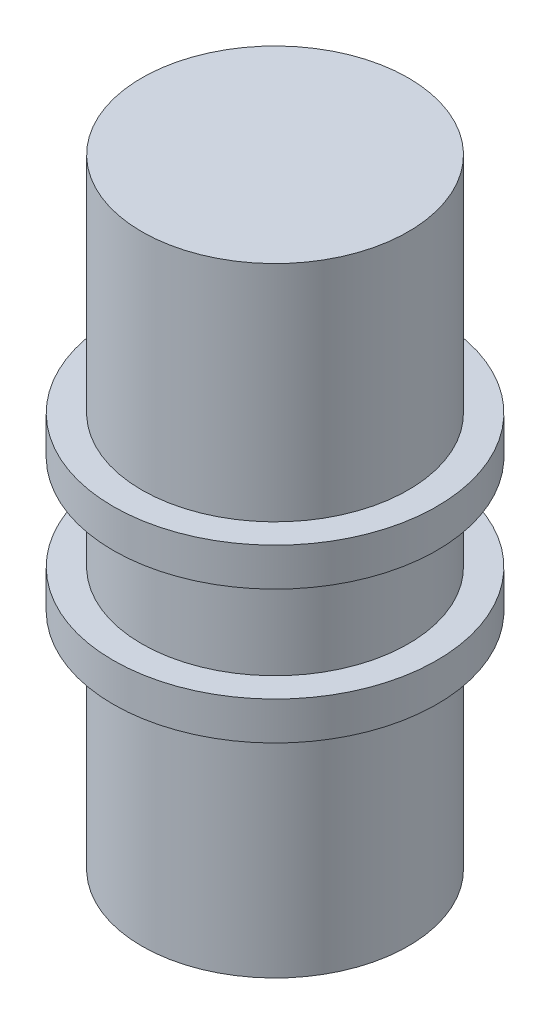
ISO-10303-21;
HEADER;
FILE_DESCRIPTION(('STEP AP214'),'2;1');
FILE_NAME('part.step','',(''),(''),'','','');
FILE_SCHEMA(('AUTOMOTIVE_DESIGN { 1 0 10303 214 1 1 1 1 }'));
ENDSEC;
DATA;
#1=APPLICATION_CONTEXT('core data for automotive mechanical design processes');
#2=APPLICATION_PROTOCOL_DEFINITION('international standard','automotive_design',2000,#1);
#3=PRODUCT_CONTEXT('',#1,'mechanical');
#4=PRODUCT('Part','Part','',(#3));
#5=PRODUCT_RELATED_PRODUCT_CATEGORY('part','',(#4));
#6=PRODUCT_DEFINITION_FORMATION('','',#4);
#7=PRODUCT_DEFINITION_CONTEXT('part definition',#1,'design');
#8=PRODUCT_DEFINITION('design','',#6,#7);
#9=PRODUCT_DEFINITION_SHAPE('','',#8);
#10=(LENGTH_UNIT() NAMED_UNIT(*) SI_UNIT(.MILLI.,.METRE.));
#11=(NAMED_UNIT(*) PLANE_ANGLE_UNIT() SI_UNIT($,.RADIAN.));
#12=(NAMED_UNIT(*) SI_UNIT($,.STERADIAN.) SOLID_ANGLE_UNIT());
#13=UNCERTAINTY_MEASURE_WITH_UNIT(LENGTH_MEASURE(1.E-05),#10,'distance_accuracy_value','');
#14=(GEOMETRIC_REPRESENTATION_CONTEXT(3) GLOBAL_UNCERTAINTY_ASSIGNED_CONTEXT((#13)) GLOBAL_UNIT_ASSIGNED_CONTEXT((#10,
#11,#12)) REPRESENTATION_CONTEXT('',''));
#15=CARTESIAN_POINT('',(0.,0.,0.));
#16=DIRECTION('',(0.,0.,1.));
#17=DIRECTION('',(1.,0.,0.));
#18=AXIS2_PLACEMENT_3D('',#15,#16,#17);
#19=CARTESIAN_POINT('',(0.,16.25,0.));
#20=DIRECTION('',(0.,-1.,0.));
#21=DIRECTION('',(0.,0.,-1.));
#22=AXIS2_PLACEMENT_3D('',#19,#20,#21);
#23=CYLINDRICAL_SURFACE('',#22,7.);
#24=CARTESIAN_POINT('',(0.,2.5,0.));
#25=DIRECTION('',(0.,1.,0.));
#26=DIRECTION('',(0.,0.,1.));
#27=AXIS2_PLACEMENT_3D('',#24,#25,#26);
#28=CIRCLE('',#27,7.);
#29=CARTESIAN_POINT('',(0.,2.5,7.));
#30=VERTEX_POINT('',#29);
#31=EDGE_CURVE('E42',#30,#30,#28,.T.);
#32=ORIENTED_EDGE('',*,*,#31,.F.);
#33=EDGE_LOOP('',(#32));
#34=FACE_BOUND('',#33,.T.);
#35=CARTESIAN_POINT('',(0.,-2.5,0.));
#36=DIRECTION('',(0.,-1.,0.));
#37=DIRECTION('',(0.,0.,-1.));
#38=AXIS2_PLACEMENT_3D('',#35,#36,#37);
#39=CIRCLE('',#38,7.);
#40=CARTESIAN_POINT('',(0.,-2.5,-7.));
#41=VERTEX_POINT('',#40);
#42=EDGE_CURVE('E10',#41,#41,#39,.T.);
#43=ORIENTED_EDGE('',*,*,#42,.F.);
#44=EDGE_LOOP('',(#43));
#45=FACE_BOUND('',#44,.T.);
#46=ADVANCED_FACE('F34',(#34,#45),#23,.T.);
#47=CARTESIAN_POINT('',(0.,4.5,0.));
#48=DIRECTION('',(0.,1.,0.));
#49=DIRECTION('',(0.,0.,1.));
#50=AXIS2_PLACEMENT_3D('',#47,#48,#49);
#51=CIRCLE('',#50,7.);
#52=CARTESIAN_POINT('',(0.,4.5,7.));
#53=VERTEX_POINT('',#52);
#54=EDGE_CURVE('E49',#53,#53,#51,.T.);
#55=ORIENTED_EDGE('',*,*,#54,.T.);
#56=EDGE_LOOP('',(#55));
#57=FACE_BOUND('',#56,.T.);
#58=CARTESIAN_POINT('',(0.,16.25,0.));
#59=DIRECTION('',(0.,1.,0.));
#60=DIRECTION('',(0.,0.,1.));
#61=AXIS2_PLACEMENT_3D('',#58,#59,#60);
#62=CIRCLE('',#61,7.);
#63=CARTESIAN_POINT('',(0.,16.25,7.));
#64=VERTEX_POINT('',#63);
#65=EDGE_CURVE('E46',#64,#64,#62,.T.);
#66=ORIENTED_EDGE('',*,*,#65,.F.);
#67=EDGE_LOOP('',(#66));
#68=FACE_BOUND('',#67,.T.);
#69=ADVANCED_FACE('F36',(#57,#68),#23,.T.);
#70=CARTESIAN_POINT('',(0.,16.25,0.));
#71=DIRECTION('',(0.,1.,0.));
#72=DIRECTION('',(0.,0.,1.));
#73=AXIS2_PLACEMENT_3D('',#70,#71,#72);
#74=PLANE('',#73);
#75=ORIENTED_EDGE('',*,*,#65,.T.);
#76=EDGE_LOOP('',(#75));
#77=FACE_BOUND('',#76,.T.);
#78=ADVANCED_FACE('F95',(#77),#74,.T.);
#79=CARTESIAN_POINT('',(0.,4.5,0.));
#80=DIRECTION('',(0.,-1.,0.));
#81=DIRECTION('',(0.,0.,-1.));
#82=AXIS2_PLACEMENT_3D('',#79,#80,#81);
#83=CYLINDRICAL_SURFACE('',#82,8.5);
#84=CARTESIAN_POINT('',(0.,4.5,0.));
#85=DIRECTION('',(0.,1.,0.));
#86=DIRECTION('',(0.,0.,1.));
#87=AXIS2_PLACEMENT_3D('',#84,#85,#86);
#88=CIRCLE('',#87,8.5);
#89=CARTESIAN_POINT('',(0.,4.5,8.5));
#90=VERTEX_POINT('',#89);
#91=EDGE_CURVE('E52',#90,#90,#88,.T.);
#92=ORIENTED_EDGE('',*,*,#91,.F.);
#93=EDGE_LOOP('',(#92));
#94=FACE_BOUND('',#93,.T.);
#95=CARTESIAN_POINT('',(0.,2.5,0.));
#96=DIRECTION('',(0.,1.,0.));
#97=DIRECTION('',(0.,0.,1.));
#98=AXIS2_PLACEMENT_3D('',#95,#96,#97);
#99=CIRCLE('',#98,8.5);
#100=CARTESIAN_POINT('',(0.,2.5,8.5));
#101=VERTEX_POINT('',#100);
#102=EDGE_CURVE('E58',#101,#101,#99,.T.);
#103=ORIENTED_EDGE('',*,*,#102,.T.);
#104=EDGE_LOOP('',(#103));
#105=FACE_BOUND('',#104,.T.);
#106=ADVANCED_FACE('F110',(#94,#105),#83,.T.);
#107=CARTESIAN_POINT('',(0.,4.5,0.));
#108=DIRECTION('',(0.,1.,0.));
#109=DIRECTION('',(0.,0.,1.));
#110=AXIS2_PLACEMENT_3D('',#107,#108,#109);
#111=PLANE('',#110);
#112=ORIENTED_EDGE('',*,*,#54,.F.);
#113=EDGE_LOOP('',(#112));
#114=FACE_BOUND('',#113,.T.);
#115=ORIENTED_EDGE('',*,*,#91,.T.);
#116=EDGE_LOOP('',(#115));
#117=FACE_BOUND('',#116,.T.);
#118=ADVANCED_FACE('F114',(#114,#117),#111,.T.);
#119=CARTESIAN_POINT('',(0.,2.5,0.));
#120=DIRECTION('',(0.,1.,0.));
#121=DIRECTION('',(0.,0.,1.));
#122=AXIS2_PLACEMENT_3D('',#119,#120,#121);
#123=PLANE('',#122);
#124=ORIENTED_EDGE('',*,*,#31,.T.);
#125=EDGE_LOOP('',(#124));
#126=FACE_BOUND('',#125,.T.);
#127=ORIENTED_EDGE('',*,*,#102,.F.);
#128=EDGE_LOOP('',(#127));
#129=FACE_BOUND('',#128,.T.);
#130=ADVANCED_FACE('F88',(#126,#129),#123,.F.);
#131=CARTESIAN_POINT('',(0.,-4.5,0.));
#132=DIRECTION('',(0.,1.,0.));
#133=DIRECTION('',(0.,0.,1.));
#134=AXIS2_PLACEMENT_3D('',#131,#132,#133);
#135=CYLINDRICAL_SURFACE('',#134,8.5);
#136=CARTESIAN_POINT('',(0.,-4.5,0.));
#137=DIRECTION('',(0.,1.,0.));
#138=DIRECTION('',(0.,0.,1.));
#139=AXIS2_PLACEMENT_3D('',#136,#137,#138);
#140=CIRCLE('',#139,8.5);
#141=CARTESIAN_POINT('',(0.,-4.5,8.5));
#142=VERTEX_POINT('',#141);
#143=EDGE_CURVE('E66',#142,#142,#140,.T.);
#144=ORIENTED_EDGE('',*,*,#143,.T.);
#145=EDGE_LOOP('',(#144));
#146=FACE_BOUND('',#145,.T.);
#147=CARTESIAN_POINT('',(0.,-2.5,0.));
#148=DIRECTION('',(0.,1.,0.));
#149=DIRECTION('',(0.,0.,1.));
#150=AXIS2_PLACEMENT_3D('',#147,#148,#149);
#151=CIRCLE('',#150,8.5);
#152=CARTESIAN_POINT('',(0.,-2.5,8.5));
#153=VERTEX_POINT('',#152);
#154=EDGE_CURVE('E63',#153,#153,#151,.T.);
#155=ORIENTED_EDGE('',*,*,#154,.F.);
#156=EDGE_LOOP('',(#155));
#157=FACE_BOUND('',#156,.T.);
#158=ADVANCED_FACE('F80',(#146,#157),#135,.T.);
#159=CARTESIAN_POINT('',(0.,-4.5,0.));
#160=DIRECTION('',(0.,-1.,0.));
#161=DIRECTION('',(0.,0.,1.));
#162=AXIS2_PLACEMENT_3D('',#159,#160,#161);
#163=PLANE('',#162);
#164=CARTESIAN_POINT('',(0.,-4.5,0.));
#165=DIRECTION('',(0.,-1.,0.));
#166=DIRECTION('',(0.,0.,-1.));
#167=AXIS2_PLACEMENT_3D('',#164,#165,#166);
#168=CIRCLE('',#167,7.);
#169=CARTESIAN_POINT('',(0.,-4.5,-7.));
#170=VERTEX_POINT('',#169);
#171=EDGE_CURVE('E38',#170,#170,#168,.T.);
#172=ORIENTED_EDGE('',*,*,#171,.F.);
#173=EDGE_LOOP('',(#172));
#174=FACE_BOUND('',#173,.T.);
#175=ORIENTED_EDGE('',*,*,#143,.F.);
#176=EDGE_LOOP('',(#175));
#177=FACE_BOUND('',#176,.T.);
#178=ADVANCED_FACE('F76',(#174,#177),#163,.T.);
#179=CARTESIAN_POINT('',(0.,-2.5,0.));
#180=DIRECTION('',(0.,-1.,0.));
#181=DIRECTION('',(0.,0.,1.));
#182=AXIS2_PLACEMENT_3D('',#179,#180,#181);
#183=PLANE('',#182);
#184=ORIENTED_EDGE('',*,*,#42,.T.);
#185=EDGE_LOOP('',(#184));
#186=FACE_BOUND('',#185,.T.);
#187=ORIENTED_EDGE('',*,*,#154,.T.);
#188=EDGE_LOOP('',(#187));
#189=FACE_BOUND('',#188,.T.);
#190=ADVANCED_FACE('F79',(#186,#189),#183,.F.);
#191=CARTESIAN_POINT('',(0.,-16.25,0.));
#192=DIRECTION('',(0.,1.,0.));
#193=DIRECTION('',(0.,0.,1.));
#194=AXIS2_PLACEMENT_3D('',#191,#192,#193);
#195=PLANE('',#194);
#196=CARTESIAN_POINT('',(0.,-16.25,0.));
#197=DIRECTION('',(0.,1.,0.));
#198=DIRECTION('',(0.,0.,1.));
#199=AXIS2_PLACEMENT_3D('',#196,#197,#198);
#200=CIRCLE('',#199,7.);
#201=CARTESIAN_POINT('',(0.,-16.25,7.));
#202=VERTEX_POINT('',#201);
#203=EDGE_CURVE('E51',#202,#202,#200,.T.);
#204=ORIENTED_EDGE('',*,*,#203,.F.);
#205=EDGE_LOOP('',(#204));
#206=FACE_BOUND('',#205,.T.);
#207=ADVANCED_FACE('F86',(#206),#195,.F.);
#208=ORIENTED_EDGE('',*,*,#171,.T.);
#209=EDGE_LOOP('',(#208));
#210=FACE_BOUND('',#209,.T.);
#211=ORIENTED_EDGE('',*,*,#203,.T.);
#212=EDGE_LOOP('',(#211));
#213=FACE_BOUND('',#212,.T.);
#214=ADVANCED_FACE('F73',(#210,#213),#23,.T.);
#215=CLOSED_SHELL('',(#46,#69,#78,#106,#118,#130,#158,#178,#190,#207,#214));
#216=MANIFOLD_SOLID_BREP('B2',#215);
#217=ADVANCED_BREP_SHAPE_REPRESENTATION('',(#18,#216),#14);
#218=SHAPE_DEFINITION_REPRESENTATION(#9,#217);
ENDSEC;
END-ISO-10303-21;
